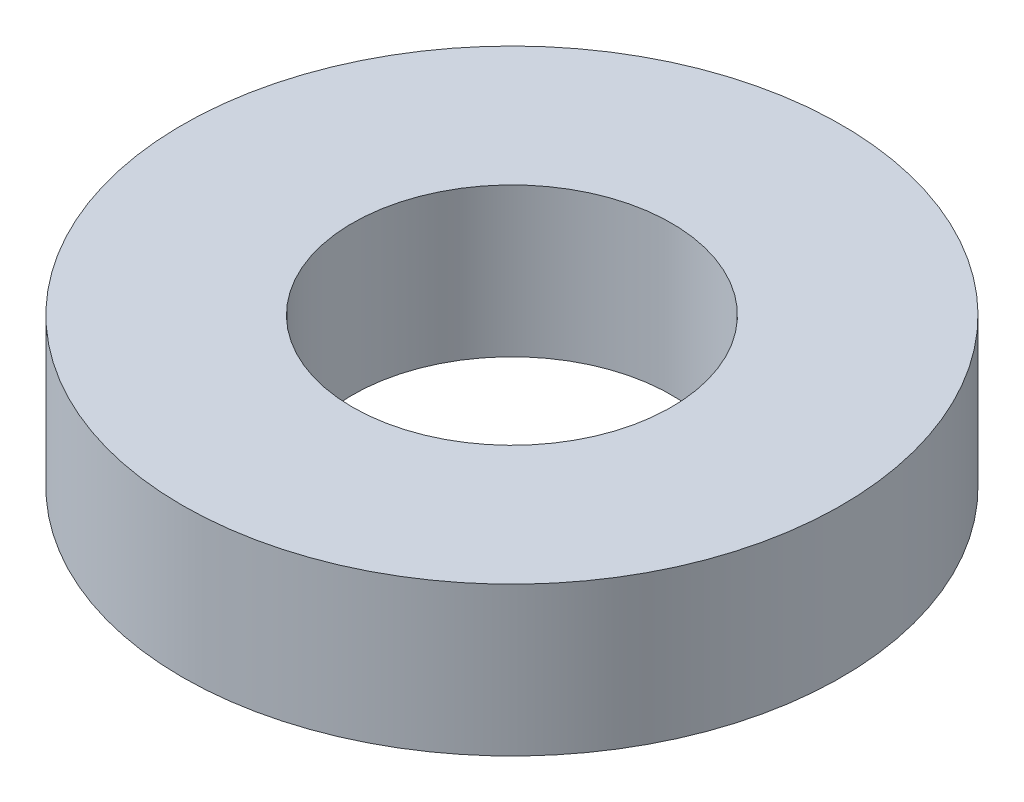
ISO-10303-21;
HEADER;
FILE_DESCRIPTION(('STEP AP214'),'2;1');
FILE_NAME('part.step','',(''),(''),'','','');
FILE_SCHEMA(('AUTOMOTIVE_DESIGN { 1 0 10303 214 1 1 1 1 }'));
ENDSEC;
DATA;
#1=APPLICATION_CONTEXT('core data for automotive mechanical design processes');
#2=APPLICATION_PROTOCOL_DEFINITION('international standard','automotive_design',2000,#1);
#3=PRODUCT_CONTEXT('',#1,'mechanical');
#4=PRODUCT('Part','Part','',(#3));
#5=PRODUCT_RELATED_PRODUCT_CATEGORY('part','',(#4));
#6=PRODUCT_DEFINITION_FORMATION('','',#4);
#7=PRODUCT_DEFINITION_CONTEXT('part definition',#1,'design');
#8=PRODUCT_DEFINITION('design','',#6,#7);
#9=PRODUCT_DEFINITION_SHAPE('','',#8);
#10=(LENGTH_UNIT() NAMED_UNIT(*) SI_UNIT(.MILLI.,.METRE.));
#11=(NAMED_UNIT(*) PLANE_ANGLE_UNIT() SI_UNIT($,.RADIAN.));
#12=(NAMED_UNIT(*) SI_UNIT($,.STERADIAN.) SOLID_ANGLE_UNIT());
#13=UNCERTAINTY_MEASURE_WITH_UNIT(LENGTH_MEASURE(1.E-05),#10,'distance_accuracy_value','');
#14=(GEOMETRIC_REPRESENTATION_CONTEXT(3) GLOBAL_UNCERTAINTY_ASSIGNED_CONTEXT((#13)) GLOBAL_UNIT_ASSIGNED_CONTEXT((#10,
#11,#12)) REPRESENTATION_CONTEXT('',''));
#15=CARTESIAN_POINT('',(0.,0.,0.));
#16=DIRECTION('',(0.,0.,1.));
#17=DIRECTION('',(1.,0.,0.));
#18=AXIS2_PLACEMENT_3D('',#15,#16,#17);
#19=CARTESIAN_POINT('',(0.,3.5,0.));
#20=DIRECTION('',(0.,1.,0.));
#21=DIRECTION('',(0.,0.,1.));
#22=AXIS2_PLACEMENT_3D('',#19,#20,#21);
#23=PLANE('',#22);
#24=CARTESIAN_POINT('',(0.,3.5,0.));
#25=DIRECTION('',(0.,1.,0.));
#26=DIRECTION('',(0.,0.,1.));
#27=AXIS2_PLACEMENT_3D('',#24,#25,#26);
#28=CIRCLE('',#27,7.75);
#29=CARTESIAN_POINT('',(0.,3.5,7.75));
#30=VERTEX_POINT('',#29);
#31=EDGE_CURVE('E10',#30,#30,#28,.T.);
#32=ORIENTED_EDGE('',*,*,#31,.T.);
#33=EDGE_LOOP('',(#32));
#34=FACE_BOUND('',#33,.T.);
#35=CARTESIAN_POINT('',(0.,3.5,0.));
#36=DIRECTION('',(0.,1.,0.));
#37=DIRECTION('',(0.,0.,1.));
#38=AXIS2_PLACEMENT_3D('',#35,#36,#37);
#39=CIRCLE('',#38,3.75);
#40=CARTESIAN_POINT('',(0.,3.5,3.75));
#41=VERTEX_POINT('',#40);
#42=EDGE_CURVE('E42',#41,#41,#39,.T.);
#43=ORIENTED_EDGE('',*,*,#42,.F.);
#44=EDGE_LOOP('',(#43));
#45=FACE_BOUND('',#44,.T.);
#46=ADVANCED_FACE('F31',(#34,#45),#23,.T.);
#47=CARTESIAN_POINT('',(0.,0.,0.));
#48=DIRECTION('',(0.,1.,0.));
#49=DIRECTION('',(0.,0.,1.));
#50=AXIS2_PLACEMENT_3D('',#47,#48,#49);
#51=PLANE('',#50);
#52=CARTESIAN_POINT('',(0.,0.,0.));
#53=DIRECTION('',(0.,1.,0.));
#54=DIRECTION('',(0.,0.,1.));
#55=AXIS2_PLACEMENT_3D('',#52,#53,#54);
#56=CIRCLE('',#55,7.75);
#57=CARTESIAN_POINT('',(0.,0.,7.75));
#58=VERTEX_POINT('',#57);
#59=EDGE_CURVE('E35',#58,#58,#56,.T.);
#60=ORIENTED_EDGE('',*,*,#59,.F.);
#61=EDGE_LOOP('',(#60));
#62=FACE_BOUND('',#61,.T.);
#63=CARTESIAN_POINT('',(0.,0.,0.));
#64=DIRECTION('',(0.,1.,0.));
#65=DIRECTION('',(0.,0.,1.));
#66=AXIS2_PLACEMENT_3D('',#63,#64,#65);
#67=CIRCLE('',#66,3.75);
#68=CARTESIAN_POINT('',(0.,0.,3.75));
#69=VERTEX_POINT('',#68);
#70=EDGE_CURVE('E44',#69,#69,#67,.T.);
#71=ORIENTED_EDGE('',*,*,#70,.T.);
#72=EDGE_LOOP('',(#71));
#73=FACE_BOUND('',#72,.T.);
#74=ADVANCED_FACE('F54',(#62,#73),#51,.F.);
#75=CARTESIAN_POINT('',(0.,3.5,0.));
#76=DIRECTION('',(0.,-1.,0.));
#77=DIRECTION('',(0.,0.,-1.));
#78=AXIS2_PLACEMENT_3D('',#75,#76,#77);
#79=CYLINDRICAL_SURFACE('',#78,7.75);
#80=ORIENTED_EDGE('',*,*,#31,.F.);
#81=EDGE_LOOP('',(#80));
#82=FACE_BOUND('',#81,.T.);
#83=ORIENTED_EDGE('',*,*,#59,.T.);
#84=EDGE_LOOP('',(#83));
#85=FACE_BOUND('',#84,.T.);
#86=ADVANCED_FACE('F33',(#82,#85),#79,.T.);
#87=CARTESIAN_POINT('',(0.,3.5,0.));
#88=DIRECTION('',(0.,-1.,0.));
#89=DIRECTION('',(0.,0.,-1.));
#90=AXIS2_PLACEMENT_3D('',#87,#88,#89);
#91=CYLINDRICAL_SURFACE('',#90,3.75);
#92=ORIENTED_EDGE('',*,*,#42,.T.);
#93=EDGE_LOOP('',(#92));
#94=FACE_BOUND('',#93,.T.);
#95=ORIENTED_EDGE('',*,*,#70,.F.);
#96=EDGE_LOOP('',(#95));
#97=FACE_BOUND('',#96,.T.);
#98=ADVANCED_FACE('F50',(#94,#97),#91,.F.);
#99=CLOSED_SHELL('',(#46,#74,#86,#98));
#100=MANIFOLD_SOLID_BREP('B2',#99);
#101=ADVANCED_BREP_SHAPE_REPRESENTATION('',(#18,#100),#14);
#102=SHAPE_DEFINITION_REPRESENTATION(#9,#101);
ENDSEC;
END-ISO-10303-21;
